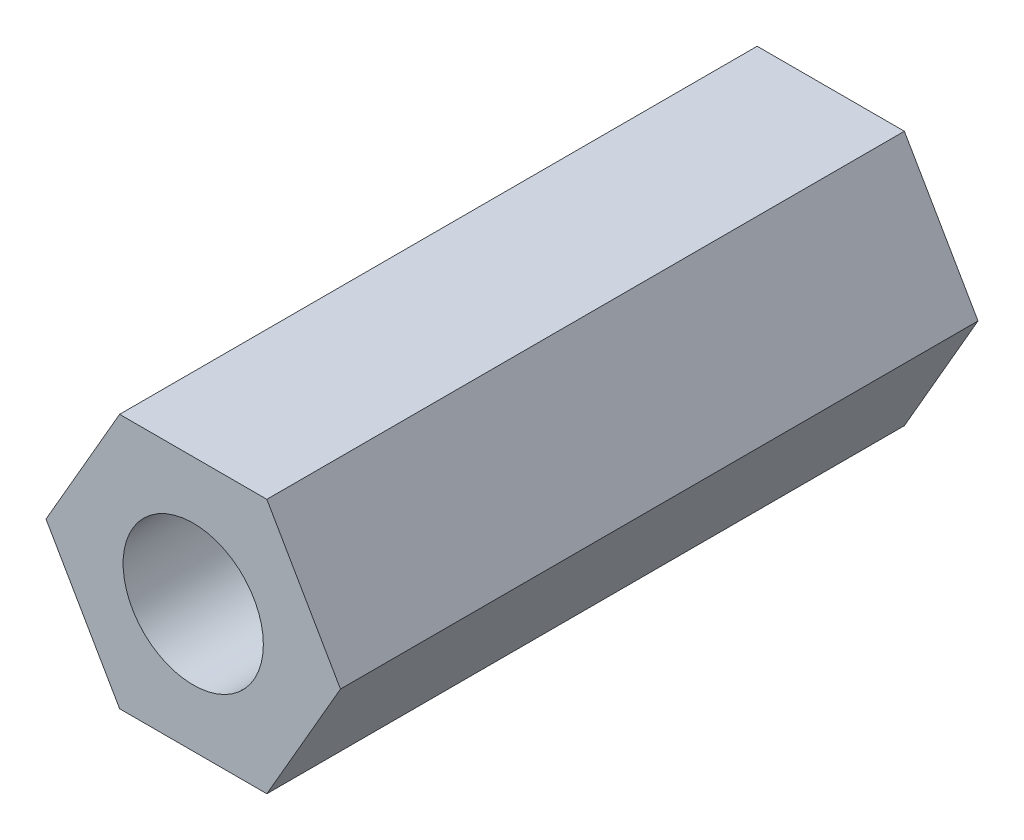
ISO-10303-21;
HEADER;
FILE_DESCRIPTION(('STEP AP214'),'2;1');
FILE_NAME('part.step','',(''),(''),'','','');
FILE_SCHEMA(('AUTOMOTIVE_DESIGN { 1 0 10303 214 1 1 1 1 }'));
ENDSEC;
DATA;
#1=APPLICATION_CONTEXT('core data for automotive mechanical design processes');
#2=APPLICATION_PROTOCOL_DEFINITION('international standard','automotive_design',2000,#1);
#3=PRODUCT_CONTEXT('',#1,'mechanical');
#4=PRODUCT('Part','Part','',(#3));
#5=PRODUCT_RELATED_PRODUCT_CATEGORY('part','',(#4));
#6=PRODUCT_DEFINITION_FORMATION('','',#4);
#7=PRODUCT_DEFINITION_CONTEXT('part definition',#1,'design');
#8=PRODUCT_DEFINITION('design','',#6,#7);
#9=PRODUCT_DEFINITION_SHAPE('','',#8);
#10=(LENGTH_UNIT() NAMED_UNIT(*) SI_UNIT(.MILLI.,.METRE.));
#11=(NAMED_UNIT(*) PLANE_ANGLE_UNIT() SI_UNIT($,.RADIAN.));
#12=(NAMED_UNIT(*) SI_UNIT($,.STERADIAN.) SOLID_ANGLE_UNIT());
#13=UNCERTAINTY_MEASURE_WITH_UNIT(LENGTH_MEASURE(1.E-05),#10,'distance_accuracy_value','');
#14=(GEOMETRIC_REPRESENTATION_CONTEXT(3) GLOBAL_UNCERTAINTY_ASSIGNED_CONTEXT((#13)) GLOBAL_UNIT_ASSIGNED_CONTEXT((#10,
#11,#12)) REPRESENTATION_CONTEXT('',''));
#15=CARTESIAN_POINT('',(0.,0.,0.));
#16=DIRECTION('',(0.,0.,1.));
#17=DIRECTION('',(1.,0.,0.));
#18=AXIS2_PLACEMENT_3D('',#15,#16,#17);
#19=CARTESIAN_POINT('',(1.73205080756888,3.,15.));
#20=DIRECTION('',(0.,-1.,0.));
#21=DIRECTION('',(1.,0.,0.));
#22=AXIS2_PLACEMENT_3D('',#19,#20,#21);
#23=PLANE('',#22);
#24=DIRECTION('',(-1.,0.,0.));
#25=VECTOR('',#24,1.);
#26=CARTESIAN_POINT('',(1.73205080756888,3.,0.));
#27=LINE('',#26,#25);
#28=CARTESIAN_POINT('',(1.73205080756888,3.,0.));
#29=VERTEX_POINT('',#28);
#30=CARTESIAN_POINT('',(-1.73205080756888,3.,0.));
#31=VERTEX_POINT('',#30);
#32=EDGE_CURVE('E121',#29,#31,#27,.T.);
#33=ORIENTED_EDGE('',*,*,#32,.T.);
#34=DIRECTION('',(0.,0.,-1.));
#35=VECTOR('',#34,1.);
#36=CARTESIAN_POINT('',(-1.73205080756888,3.,15.));
#37=LINE('',#36,#35);
#38=CARTESIAN_POINT('',(-1.73205080756888,3.,15.));
#39=VERTEX_POINT('',#38);
#40=EDGE_CURVE('E11',#39,#31,#37,.T.);
#41=ORIENTED_EDGE('',*,*,#40,.F.);
#42=DIRECTION('',(-1.,0.,0.));
#43=VECTOR('',#42,1.);
#44=CARTESIAN_POINT('',(1.73205080756888,3.,15.));
#45=LINE('',#44,#43);
#46=CARTESIAN_POINT('',(1.73205080756888,3.,15.));
#47=VERTEX_POINT('',#46);
#48=EDGE_CURVE('E132',#47,#39,#45,.T.);
#49=ORIENTED_EDGE('',*,*,#48,.F.);
#50=DIRECTION('',(0.,0.,-1.));
#51=VECTOR('',#50,1.);
#52=CARTESIAN_POINT('',(1.73205080756888,3.,15.));
#53=LINE('',#52,#51);
#54=EDGE_CURVE('E117',#47,#29,#53,.T.);
#55=ORIENTED_EDGE('',*,*,#54,.T.);
#56=EDGE_LOOP('',(#33,#41,#49,#55));
#57=FACE_BOUND('',#56,.T.);
#58=ADVANCED_FACE('F37',(#57),#23,.F.);
#59=CARTESIAN_POINT('',(-1.73205080756888,3.,15.));
#60=DIRECTION('',(0.866025403784439,-0.5,0.));
#61=DIRECTION('',(0.5,0.866025403784439,0.));
#62=AXIS2_PLACEMENT_3D('',#59,#60,#61);
#63=PLANE('',#62);
#64=DIRECTION('',(-0.5,-0.866025403784439,0.));
#65=VECTOR('',#64,1.);
#66=CARTESIAN_POINT('',(-1.73205080756888,3.,0.));
#67=LINE('',#66,#65);
#68=CARTESIAN_POINT('',(-3.46410161513775,0.,0.));
#69=VERTEX_POINT('',#68);
#70=EDGE_CURVE('E124',#31,#69,#67,.T.);
#71=ORIENTED_EDGE('',*,*,#70,.T.);
#72=DIRECTION('',(0.,0.,-1.));
#73=VECTOR('',#72,1.);
#74=CARTESIAN_POINT('',(-3.46410161513775,0.,15.));
#75=LINE('',#74,#73);
#76=CARTESIAN_POINT('',(-3.46410161513775,0.,15.));
#77=VERTEX_POINT('',#76);
#78=EDGE_CURVE('E45',#77,#69,#75,.T.);
#79=ORIENTED_EDGE('',*,*,#78,.F.);
#80=DIRECTION('',(-0.5,-0.866025403784439,0.));
#81=VECTOR('',#80,1.);
#82=CARTESIAN_POINT('',(-1.73205080756888,3.,15.));
#83=LINE('',#82,#81);
#84=EDGE_CURVE('E90',#39,#77,#83,.T.);
#85=ORIENTED_EDGE('',*,*,#84,.F.);
#86=ORIENTED_EDGE('',*,*,#40,.T.);
#87=EDGE_LOOP('',(#71,#79,#85,#86));
#88=FACE_BOUND('',#87,.T.);
#89=ADVANCED_FACE('F157',(#88),#63,.F.);
#90=CARTESIAN_POINT('',(-3.46410161513775,0.,15.));
#91=DIRECTION('',(0.866025403784438,0.5,0.));
#92=DIRECTION('',(-0.5,0.866025403784438,0.));
#93=AXIS2_PLACEMENT_3D('',#90,#91,#92);
#94=PLANE('',#93);
#95=DIRECTION('',(0.5,-0.866025403784438,0.));
#96=VECTOR('',#95,1.);
#97=CARTESIAN_POINT('',(-3.46410161513775,0.,0.));
#98=LINE('',#97,#96);
#99=CARTESIAN_POINT('',(-1.73205080756888,-3.,0.));
#100=VERTEX_POINT('',#99);
#101=EDGE_CURVE('E127',#69,#100,#98,.T.);
#102=ORIENTED_EDGE('',*,*,#101,.T.);
#103=DIRECTION('',(0.,0.,-1.));
#104=VECTOR('',#103,1.);
#105=CARTESIAN_POINT('',(-1.73205080756888,-3.,15.));
#106=LINE('',#105,#104);
#107=CARTESIAN_POINT('',(-1.73205080756888,-3.,15.));
#108=VERTEX_POINT('',#107);
#109=EDGE_CURVE('E112',#108,#100,#106,.T.);
#110=ORIENTED_EDGE('',*,*,#109,.F.);
#111=DIRECTION('',(0.5,-0.866025403784438,0.));
#112=VECTOR('',#111,1.);
#113=CARTESIAN_POINT('',(-3.46410161513775,0.,15.));
#114=LINE('',#113,#112);
#115=EDGE_CURVE('E103',#77,#108,#114,.T.);
#116=ORIENTED_EDGE('',*,*,#115,.F.);
#117=ORIENTED_EDGE('',*,*,#78,.T.);
#118=EDGE_LOOP('',(#102,#110,#116,#117));
#119=FACE_BOUND('',#118,.T.);
#120=ADVANCED_FACE('F138',(#119),#94,.F.);
#121=CARTESIAN_POINT('',(-1.73205080756888,-3.,15.));
#122=DIRECTION('',(0.,1.,0.));
#123=DIRECTION('',(-1.,0.,0.));
#124=AXIS2_PLACEMENT_3D('',#121,#122,#123);
#125=PLANE('',#124);
#126=DIRECTION('',(1.,0.,0.));
#127=VECTOR('',#126,1.);
#128=CARTESIAN_POINT('',(-1.73205080756888,-3.,0.));
#129=LINE('',#128,#127);
#130=CARTESIAN_POINT('',(1.73205080756888,-3.,0.));
#131=VERTEX_POINT('',#130);
#132=EDGE_CURVE('E111',#100,#131,#129,.T.);
#133=ORIENTED_EDGE('',*,*,#132,.T.);
#134=DIRECTION('',(0.,0.,-1.));
#135=VECTOR('',#134,1.);
#136=CARTESIAN_POINT('',(1.73205080756888,-3.,15.));
#137=LINE('',#136,#135);
#138=CARTESIAN_POINT('',(1.73205080756888,-3.,15.));
#139=VERTEX_POINT('',#138);
#140=EDGE_CURVE('E108',#139,#131,#137,.T.);
#141=ORIENTED_EDGE('',*,*,#140,.F.);
#142=DIRECTION('',(1.,0.,0.));
#143=VECTOR('',#142,1.);
#144=CARTESIAN_POINT('',(-1.73205080756888,-3.,15.));
#145=LINE('',#144,#143);
#146=EDGE_CURVE('E97',#108,#139,#145,.T.);
#147=ORIENTED_EDGE('',*,*,#146,.F.);
#148=ORIENTED_EDGE('',*,*,#109,.T.);
#149=EDGE_LOOP('',(#133,#141,#147,#148));
#150=FACE_BOUND('',#149,.T.);
#151=ADVANCED_FACE('F109',(#150),#125,.F.);
#152=CARTESIAN_POINT('',(1.73205080756888,-3.,15.));
#153=DIRECTION('',(-0.866025403784439,0.5,0.));
#154=DIRECTION('',(-0.5,-0.866025403784439,0.));
#155=AXIS2_PLACEMENT_3D('',#152,#153,#154);
#156=PLANE('',#155);
#157=DIRECTION('',(0.5,0.866025403784439,0.));
#158=VECTOR('',#157,1.);
#159=CARTESIAN_POINT('',(1.73205080756888,-3.,0.));
#160=LINE('',#159,#158);
#161=CARTESIAN_POINT('',(3.46410161513775,0.,0.));
#162=VERTEX_POINT('',#161);
#163=EDGE_CURVE('E76',#131,#162,#160,.T.);
#164=ORIENTED_EDGE('',*,*,#163,.T.);
#165=DIRECTION('',(0.,0.,-1.));
#166=VECTOR('',#165,1.);
#167=CARTESIAN_POINT('',(3.46410161513775,0.,15.));
#168=LINE('',#167,#166);
#169=CARTESIAN_POINT('',(3.46410161513775,0.,15.));
#170=VERTEX_POINT('',#169);
#171=EDGE_CURVE('E113',#170,#162,#168,.T.);
#172=ORIENTED_EDGE('',*,*,#171,.F.);
#173=DIRECTION('',(0.5,0.866025403784439,0.));
#174=VECTOR('',#173,1.);
#175=CARTESIAN_POINT('',(1.73205080756888,-3.,15.));
#176=LINE('',#175,#174);
#177=EDGE_CURVE('E101',#139,#170,#176,.T.);
#178=ORIENTED_EDGE('',*,*,#177,.F.);
#179=ORIENTED_EDGE('',*,*,#140,.T.);
#180=EDGE_LOOP('',(#164,#172,#178,#179));
#181=FACE_BOUND('',#180,.T.);
#182=ADVANCED_FACE('F115',(#181),#156,.F.);
#183=CARTESIAN_POINT('',(3.46410161513775,0.,15.));
#184=DIRECTION('',(-0.866025403784439,-0.5,0.));
#185=DIRECTION('',(0.5,-0.866025403784439,0.));
#186=AXIS2_PLACEMENT_3D('',#183,#184,#185);
#187=PLANE('',#186);
#188=DIRECTION('',(-0.5,0.866025403784439,0.));
#189=VECTOR('',#188,1.);
#190=CARTESIAN_POINT('',(3.46410161513775,0.,0.));
#191=LINE('',#190,#189);
#192=EDGE_CURVE('E82',#162,#29,#191,.T.);
#193=ORIENTED_EDGE('',*,*,#192,.T.);
#194=ORIENTED_EDGE('',*,*,#54,.F.);
#195=DIRECTION('',(-0.5,0.866025403784439,0.));
#196=VECTOR('',#195,1.);
#197=CARTESIAN_POINT('',(3.46410161513775,0.,15.));
#198=LINE('',#197,#196);
#199=EDGE_CURVE('E53',#170,#47,#198,.T.);
#200=ORIENTED_EDGE('',*,*,#199,.F.);
#201=ORIENTED_EDGE('',*,*,#171,.T.);
#202=EDGE_LOOP('',(#193,#194,#200,#201));
#203=FACE_BOUND('',#202,.T.);
#204=ADVANCED_FACE('F145',(#203),#187,.F.);
#205=CARTESIAN_POINT('',(0.,0.,15.));
#206=DIRECTION('',(0.,0.,1.));
#207=DIRECTION('',(1.,0.,0.));
#208=AXIS2_PLACEMENT_3D('',#205,#206,#207);
#209=PLANE('',#208);
#210=CARTESIAN_POINT('',(0.,0.,15.));
#211=DIRECTION('',(0.,0.,1.));
#212=DIRECTION('',(1.,0.,0.));
#213=AXIS2_PLACEMENT_3D('',#210,#211,#212);
#214=CIRCLE('',#213,1.65);
#215=CARTESIAN_POINT('',(1.65,0.,15.));
#216=VERTEX_POINT('',#215);
#217=EDGE_CURVE('E212',#216,#216,#214,.T.);
#218=ORIENTED_EDGE('',*,*,#217,.F.);
#219=EDGE_LOOP('',(#218));
#220=FACE_BOUND('',#219,.T.);
#221=ORIENTED_EDGE('',*,*,#48,.T.);
#222=ORIENTED_EDGE('',*,*,#84,.T.);
#223=ORIENTED_EDGE('',*,*,#115,.T.);
#224=ORIENTED_EDGE('',*,*,#146,.T.);
#225=ORIENTED_EDGE('',*,*,#177,.T.);
#226=ORIENTED_EDGE('',*,*,#199,.T.);
#227=EDGE_LOOP('',(#221,#222,#223,#224,#225,#226));
#228=FACE_BOUND('',#227,.T.);
#229=ADVANCED_FACE('F99',(#220,#228),#209,.T.);
#230=CARTESIAN_POINT('',(0.,0.,0.));
#231=DIRECTION('',(0.,0.,1.));
#232=DIRECTION('',(1.,0.,0.));
#233=AXIS2_PLACEMENT_3D('',#230,#231,#232);
#234=PLANE('',#233);
#235=CARTESIAN_POINT('',(0.,0.,0.));
#236=DIRECTION('',(0.,0.,1.));
#237=DIRECTION('',(1.,0.,0.));
#238=AXIS2_PLACEMENT_3D('',#235,#236,#237);
#239=CIRCLE('',#238,1.65);
#240=CARTESIAN_POINT('',(1.65,0.,0.));
#241=VERTEX_POINT('',#240);
#242=EDGE_CURVE('E125',#241,#241,#239,.T.);
#243=ORIENTED_EDGE('',*,*,#242,.T.);
#244=EDGE_LOOP('',(#243));
#245=FACE_BOUND('',#244,.T.);
#246=ORIENTED_EDGE('',*,*,#32,.F.);
#247=ORIENTED_EDGE('',*,*,#192,.F.);
#248=ORIENTED_EDGE('',*,*,#163,.F.);
#249=ORIENTED_EDGE('',*,*,#132,.F.);
#250=ORIENTED_EDGE('',*,*,#101,.F.);
#251=ORIENTED_EDGE('',*,*,#70,.F.);
#252=EDGE_LOOP('',(#246,#247,#248,#249,#250,#251));
#253=FACE_BOUND('',#252,.T.);
#254=ADVANCED_FACE('F141',(#245,#253),#234,.F.);
#255=CARTESIAN_POINT('',(0.,0.,15.));
#256=DIRECTION('',(0.,0.,1.));
#257=DIRECTION('',(1.,0.,0.));
#258=AXIS2_PLACEMENT_3D('',#255,#256,#257);
#259=CYLINDRICAL_SURFACE('',#258,1.65);
#260=ORIENTED_EDGE('',*,*,#217,.T.);
#261=EDGE_LOOP('',(#260));
#262=FACE_BOUND('',#261,.T.);
#263=ORIENTED_EDGE('',*,*,#242,.F.);
#264=EDGE_LOOP('',(#263));
#265=FACE_BOUND('',#264,.T.);
#266=ADVANCED_FACE('F194',(#262,#265),#259,.F.);
#267=CLOSED_SHELL('',(#58,#89,#120,#151,#182,#204,#229,#254,#266));
#268=MANIFOLD_SOLID_BREP('B2',#267);
#269=ADVANCED_BREP_SHAPE_REPRESENTATION('',(#18,#268),#14);
#270=SHAPE_DEFINITION_REPRESENTATION(#9,#269);
ENDSEC;
END-ISO-10303-21;
